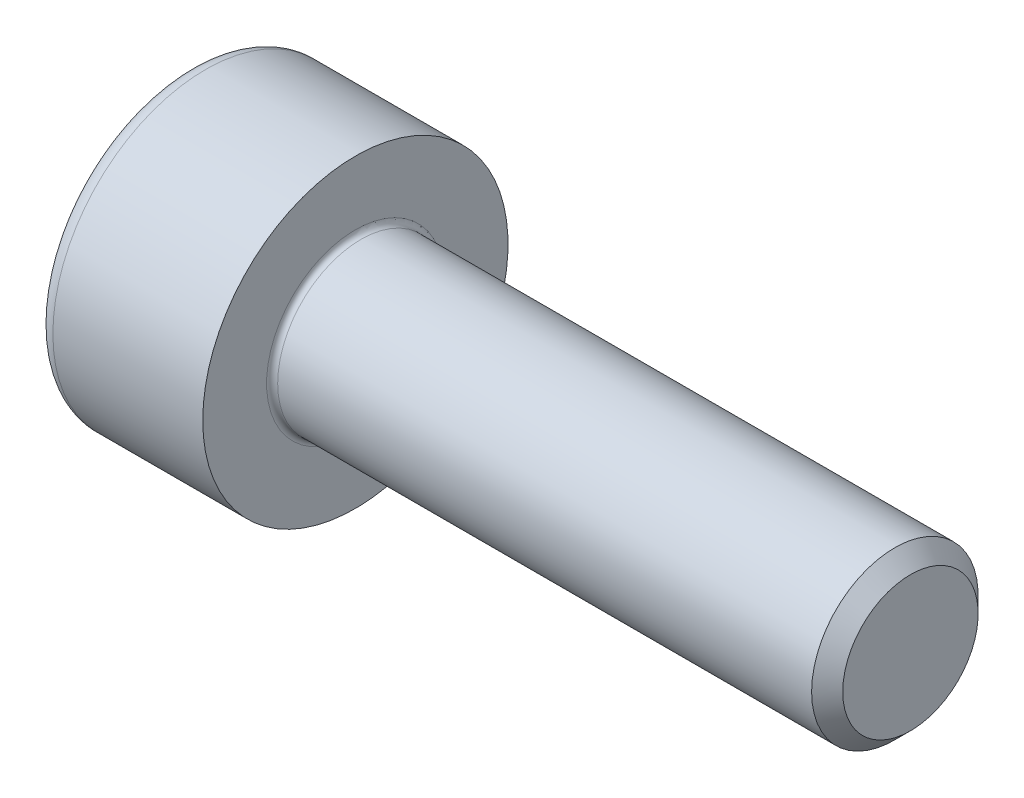
ISO-10303-21;
HEADER;
FILE_DESCRIPTION(('STEP AP214'),'2;1');
FILE_NAME('part.step','',(''),(''),'','','');
FILE_SCHEMA(('AUTOMOTIVE_DESIGN { 1 0 10303 214 1 1 1 1 }'));
ENDSEC;
DATA;
#1=APPLICATION_CONTEXT('core data for automotive mechanical design processes');
#2=APPLICATION_PROTOCOL_DEFINITION('international standard','automotive_design',2000,#1);
#3=PRODUCT_CONTEXT('',#1,'mechanical');
#4=PRODUCT('Part','Part','',(#3));
#5=PRODUCT_RELATED_PRODUCT_CATEGORY('part','',(#4));
#6=PRODUCT_DEFINITION_FORMATION('','',#4);
#7=PRODUCT_DEFINITION_CONTEXT('part definition',#1,'design');
#8=PRODUCT_DEFINITION('design','',#6,#7);
#9=PRODUCT_DEFINITION_SHAPE('','',#8);
#10=(LENGTH_UNIT() NAMED_UNIT(*) SI_UNIT(.MILLI.,.METRE.));
#11=(NAMED_UNIT(*) PLANE_ANGLE_UNIT() SI_UNIT($,.RADIAN.));
#12=(NAMED_UNIT(*) SI_UNIT($,.STERADIAN.) SOLID_ANGLE_UNIT());
#13=UNCERTAINTY_MEASURE_WITH_UNIT(LENGTH_MEASURE(1.E-05),#10,'distance_accuracy_value','');
#14=(GEOMETRIC_REPRESENTATION_CONTEXT(3) GLOBAL_UNCERTAINTY_ASSIGNED_CONTEXT((#13)) GLOBAL_UNIT_ASSIGNED_CONTEXT((#10,
#11,#12)) REPRESENTATION_CONTEXT('',''));
#15=CARTESIAN_POINT('',(0.,0.,0.));
#16=DIRECTION('',(0.,0.,1.));
#17=DIRECTION('',(1.,0.,0.));
#18=AXIS2_PLACEMENT_3D('',#15,#16,#17);
#19=CARTESIAN_POINT('',(0.,0.,0.));
#20=DIRECTION('',(-1.,0.,0.));
#21=DIRECTION('',(0.,0.,1.));
#22=AXIS2_PLACEMENT_3D('',#19,#20,#21);
#23=PLANE('',#22);
#24=DIRECTION('',(0.,-0.499999999999998,0.86602540378444));
#25=VECTOR('',#24,1.);
#26=CARTESIAN_POINT('',(0.,1.45492267835785,0.));
#27=LINE('',#26,#25);
#28=CARTESIAN_POINT('',(0.,1.45492267835785,0.));
#29=VERTEX_POINT('',#28);
#30=CARTESIAN_POINT('',(0.,0.727461339178926,1.26));
#31=VERTEX_POINT('',#30);
#32=EDGE_CURVE('E267',#29,#31,#27,.T.);
#33=ORIENTED_EDGE('',*,*,#32,.T.);
#34=DIRECTION('',(0.,1.,0.));
#35=VECTOR('',#34,1.);
#36=CARTESIAN_POINT('',(0.,-0.72746133917893,1.26));
#37=LINE('',#36,#35);
#38=CARTESIAN_POINT('',(0.,-0.72746133917893,1.26));
#39=VERTEX_POINT('',#38);
#40=EDGE_CURVE('E128',#39,#31,#37,.T.);
#41=ORIENTED_EDGE('',*,*,#40,.F.);
#42=DIRECTION('',(0.,-0.500000000000001,-0.866025403784438));
#43=VECTOR('',#42,1.);
#44=CARTESIAN_POINT('',(0.,-0.72746133917893,1.26));
#45=LINE('',#44,#43);
#46=CARTESIAN_POINT('',(0.,-1.45492267835786,0.));
#47=VERTEX_POINT('',#46);
#48=EDGE_CURVE('E270',#39,#47,#45,.T.);
#49=ORIENTED_EDGE('',*,*,#48,.T.);
#50=DIRECTION('',(0.,0.499999999999998,-0.86602540378444));
#51=VECTOR('',#50,1.);
#52=CARTESIAN_POINT('',(0.,-1.45492267835786,0.));
#53=LINE('',#52,#51);
#54=CARTESIAN_POINT('',(0.,-0.727461339178935,-1.26));
#55=VERTEX_POINT('',#54);
#56=EDGE_CURVE('E273',#47,#55,#53,.T.);
#57=ORIENTED_EDGE('',*,*,#56,.T.);
#58=DIRECTION('',(0.,-1.,0.));
#59=VECTOR('',#58,1.);
#60=CARTESIAN_POINT('',(0.,0.727461339178922,-1.26));
#61=LINE('',#60,#59);
#62=CARTESIAN_POINT('',(0.,0.727461339178922,-1.26));
#63=VERTEX_POINT('',#62);
#64=EDGE_CURVE('E276',#63,#55,#61,.T.);
#65=ORIENTED_EDGE('',*,*,#64,.F.);
#66=DIRECTION('',(0.,-0.500000000000001,-0.866025403784438));
#67=VECTOR('',#66,1.);
#68=CARTESIAN_POINT('',(0.,1.45492267835785,0.));
#69=LINE('',#68,#67);
#70=EDGE_CURVE('E123',#29,#63,#69,.T.);
#71=ORIENTED_EDGE('',*,*,#70,.F.);
#72=EDGE_LOOP('',(#33,#41,#49,#57,#65,#71));
#73=FACE_BOUND('',#72,.T.);
#74=CARTESIAN_POINT('',(0.,0.,0.));
#75=DIRECTION('',(-1.,0.,0.));
#76=DIRECTION('',(0.,0.,1.));
#77=AXIS2_PLACEMENT_3D('',#74,#75,#76);
#78=CIRCLE('',#77,2.45);
#79=CARTESIAN_POINT('',(0.,0.,2.45));
#80=VERTEX_POINT('',#79);
#81=EDGE_CURVE('E44',#80,#80,#78,.T.);
#82=ORIENTED_EDGE('',*,*,#81,.T.);
#83=EDGE_LOOP('',(#82));
#84=FACE_BOUND('',#83,.T.);
#85=ADVANCED_FACE('F36',(#73,#84),#23,.T.);
#86=CARTESIAN_POINT('',(-31.75,0.,0.));
#87=DIRECTION('',(-1.,0.,0.));
#88=DIRECTION('',(0.,0.,1.));
#89=AXIS2_PLACEMENT_3D('',#86,#87,#88);
#90=CYLINDRICAL_SURFACE('',#89,2.75);
#91=CARTESIAN_POINT('',(0.300000000000002,0.,0.));
#92=DIRECTION('',(-1.,0.,0.));
#93=DIRECTION('',(0.,0.,1.));
#94=AXIS2_PLACEMENT_3D('',#91,#92,#93);
#95=CIRCLE('',#94,2.75);
#96=CARTESIAN_POINT('',(0.300000000000002,0.,2.75));
#97=VERTEX_POINT('',#96);
#98=EDGE_CURVE('E11',#97,#97,#95,.F.);
#99=ORIENTED_EDGE('',*,*,#98,.T.);
#100=EDGE_LOOP('',(#99));
#101=FACE_BOUND('',#100,.T.);
#102=CARTESIAN_POINT('',(3.,0.,0.));
#103=DIRECTION('',(-1.,0.,0.));
#104=DIRECTION('',(0.,0.,1.));
#105=AXIS2_PLACEMENT_3D('',#102,#103,#104);
#106=CIRCLE('',#105,2.75);
#107=CARTESIAN_POINT('',(3.,0.,2.75));
#108=VERTEX_POINT('',#107);
#109=EDGE_CURVE('E146',#108,#108,#106,.T.);
#110=ORIENTED_EDGE('',*,*,#109,.T.);
#111=EDGE_LOOP('',(#110));
#112=FACE_BOUND('',#111,.T.);
#113=ADVANCED_FACE('F170',(#101,#112),#90,.T.);
#114=CARTESIAN_POINT('',(3.,2.75,0.));
#115=DIRECTION('',(1.,0.,0.));
#116=DIRECTION('',(0.,0.,-1.));
#117=AXIS2_PLACEMENT_3D('',#114,#115,#116);
#118=PLANE('',#117);
#119=CARTESIAN_POINT('',(3.,0.,0.));
#120=DIRECTION('',(1.,0.,0.));
#121=DIRECTION('',(0.,0.,-1.));
#122=AXIS2_PLACEMENT_3D('',#119,#120,#121);
#123=CIRCLE('',#122,1.59999999999999);
#124=CARTESIAN_POINT('',(3.,0.,-1.59999999999999));
#125=VERTEX_POINT('',#124);
#126=EDGE_CURVE('E149',#125,#125,#123,.F.);
#127=ORIENTED_EDGE('',*,*,#126,.T.);
#128=EDGE_LOOP('',(#127));
#129=FACE_BOUND('',#128,.T.);
#130=ORIENTED_EDGE('',*,*,#109,.F.);
#131=EDGE_LOOP('',(#130));
#132=FACE_BOUND('',#131,.T.);
#133=ADVANCED_FACE('F176',(#129,#132),#118,.T.);
#134=CARTESIAN_POINT('',(-31.75,0.,0.));
#135=DIRECTION('',(-1.,0.,0.));
#136=DIRECTION('',(0.,0.,1.));
#137=AXIS2_PLACEMENT_3D('',#134,#135,#136);
#138=CYLINDRICAL_SURFACE('',#137,1.49999999999999);
#139=CARTESIAN_POINT('',(3.1,0.,0.));
#140=DIRECTION('',(1.,0.,0.));
#141=DIRECTION('',(0.,0.,-1.));
#142=AXIS2_PLACEMENT_3D('',#139,#140,#141);
#143=CIRCLE('',#142,1.49999999999999);
#144=CARTESIAN_POINT('',(3.1,0.,-1.49999999999999));
#145=VERTEX_POINT('',#144);
#146=EDGE_CURVE('E152',#145,#145,#143,.T.);
#147=ORIENTED_EDGE('',*,*,#146,.T.);
#148=EDGE_LOOP('',(#147));
#149=FACE_BOUND('',#148,.T.);
#150=CARTESIAN_POINT('',(12.7195,0.,0.));
#151=DIRECTION('',(-1.,0.,0.));
#152=DIRECTION('',(0.,0.,1.));
#153=AXIS2_PLACEMENT_3D('',#150,#151,#152);
#154=CIRCLE('',#153,1.49999999999997);
#155=CARTESIAN_POINT('',(12.7195,0.,1.49999999999997));
#156=VERTEX_POINT('',#155);
#157=EDGE_CURVE('E143',#156,#156,#154,.T.);
#158=ORIENTED_EDGE('',*,*,#157,.T.);
#159=EDGE_LOOP('',(#158));
#160=FACE_BOUND('',#159,.T.);
#161=ADVANCED_FACE('F182',(#149,#160),#138,.T.);
#162=CARTESIAN_POINT('',(13.,0.,0.));
#163=DIRECTION('',(-1.,0.,0.));
#164=DIRECTION('',(0.,0.,1.));
#165=AXIS2_PLACEMENT_3D('',#162,#163,#164);
#166=CONICAL_SURFACE('',#165,1.2195,0.785398163397355);
#167=ORIENTED_EDGE('',*,*,#157,.F.);
#168=EDGE_LOOP('',(#167));
#169=FACE_BOUND('',#168,.T.);
#170=CARTESIAN_POINT('',(13.,0.,0.));
#171=DIRECTION('',(-1.,0.,0.));
#172=DIRECTION('',(0.,0.,1.));
#173=AXIS2_PLACEMENT_3D('',#170,#171,#172);
#174=CIRCLE('',#173,1.2195);
#175=CARTESIAN_POINT('',(13.,0.,1.2195));
#176=VERTEX_POINT('',#175);
#177=EDGE_CURVE('E139',#176,#176,#174,.T.);
#178=ORIENTED_EDGE('',*,*,#177,.T.);
#179=EDGE_LOOP('',(#178));
#180=FACE_BOUND('',#179,.T.);
#181=ADVANCED_FACE('F186',(#169,#180),#166,.T.);
#182=CARTESIAN_POINT('',(13.,1.2195,0.));
#183=DIRECTION('',(1.,0.,0.));
#184=DIRECTION('',(0.,0.,-1.));
#185=AXIS2_PLACEMENT_3D('',#182,#183,#184);
#186=PLANE('',#185);
#187=ORIENTED_EDGE('',*,*,#177,.F.);
#188=EDGE_LOOP('',(#187));
#189=FACE_BOUND('',#188,.T.);
#190=ADVANCED_FACE('F166',(#189),#186,.T.);
#191=CARTESIAN_POINT('',(3.1,0.,0.));
#192=DIRECTION('',(1.,0.,0.));
#193=DIRECTION('',(0.,0.,-1.));
#194=AXIS2_PLACEMENT_3D('',#191,#192,#193);
#195=TOROIDAL_SURFACE('',#194,1.59999999999999,0.1);
#196=ORIENTED_EDGE('',*,*,#146,.F.);
#197=EDGE_LOOP('',(#196));
#198=FACE_BOUND('',#197,.T.);
#199=ORIENTED_EDGE('',*,*,#126,.F.);
#200=EDGE_LOOP('',(#199));
#201=FACE_BOUND('',#200,.T.);
#202=ADVANCED_FACE('F159',(#198,#201),#195,.F.);
#203=CARTESIAN_POINT('',(0.300000000000002,0.,0.));
#204=DIRECTION('',(-1.,0.,0.));
#205=DIRECTION('',(0.,0.,1.));
#206=AXIS2_PLACEMENT_3D('',#203,#204,#205);
#207=TOROIDAL_SURFACE('',#206,2.45,0.3);
#208=ORIENTED_EDGE('',*,*,#98,.F.);
#209=EDGE_LOOP('',(#208));
#210=FACE_BOUND('',#209,.T.);
#211=ORIENTED_EDGE('',*,*,#81,.F.);
#212=EDGE_LOOP('',(#211));
#213=FACE_BOUND('',#212,.T.);
#214=ADVANCED_FACE('F38',(#210,#213),#207,.T.);
#215=CARTESIAN_POINT('',(1.3,1.45492267835785,0.));
#216=DIRECTION('',(0.,-0.86602540378444,-0.499999999999998));
#217=DIRECTION('',(0.,0.499999999999998,-0.86602540378444));
#218=AXIS2_PLACEMENT_3D('',#215,#216,#217);
#219=PLANE('',#218);
#220=ORIENTED_EDGE('',*,*,#32,.F.);
#221=DIRECTION('',(-1.,0.,0.));
#222=VECTOR('',#221,1.);
#223=CARTESIAN_POINT('',(1.3,1.45492267835785,0.));
#224=LINE('',#223,#222);
#225=CARTESIAN_POINT('',(1.3,1.45492267835785,0.));
#226=VERTEX_POINT('',#225);
#227=EDGE_CURVE('E266',#226,#29,#224,.T.);
#228=ORIENTED_EDGE('',*,*,#227,.F.);
#229=DIRECTION('',(0.,-0.499999999999998,0.86602540378444));
#230=VECTOR('',#229,1.);
#231=CARTESIAN_POINT('',(1.3,1.45492267835785,0.));
#232=LINE('',#231,#230);
#233=CARTESIAN_POINT('',(1.3,1.09119200876839,0.629999999999997));
#234=VERTEX_POINT('',#233);
#235=EDGE_CURVE('E51',#226,#234,#232,.T.);
#236=ORIENTED_EDGE('',*,*,#235,.T.);
#237=CARTESIAN_POINT('',(1.3,0.727461339178926,1.26));
#238=VERTEX_POINT('',#237);
#239=EDGE_CURVE('E109',#234,#238,#232,.T.);
#240=ORIENTED_EDGE('',*,*,#239,.T.);
#241=DIRECTION('',(-1.,0.,0.));
#242=VECTOR('',#241,1.);
#243=CARTESIAN_POINT('',(1.3,0.727461339178926,1.26));
#244=LINE('',#243,#242);
#245=EDGE_CURVE('E121',#238,#31,#244,.T.);
#246=ORIENTED_EDGE('',*,*,#245,.T.);
#247=EDGE_LOOP('',(#220,#228,#236,#240,#246));
#248=FACE_BOUND('',#247,.T.);
#249=ADVANCED_FACE('F120',(#248),#219,.T.);
#250=CARTESIAN_POINT('',(1.3,-0.72746133917893,1.26));
#251=DIRECTION('',(0.,0.,1.));
#252=DIRECTION('',(0.,-1.,0.));
#253=AXIS2_PLACEMENT_3D('',#250,#251,#252);
#254=PLANE('',#253);
#255=ORIENTED_EDGE('',*,*,#40,.T.);
#256=ORIENTED_EDGE('',*,*,#245,.F.);
#257=DIRECTION('',(0.,1.,0.));
#258=VECTOR('',#257,1.);
#259=CARTESIAN_POINT('',(1.3,-0.72746133917893,1.26));
#260=LINE('',#259,#258);
#261=CARTESIAN_POINT('',(1.3,0.,1.26));
#262=VERTEX_POINT('',#261);
#263=EDGE_CURVE('E107',#262,#238,#260,.T.);
#264=ORIENTED_EDGE('',*,*,#263,.F.);
#265=CARTESIAN_POINT('',(1.3,-0.72746133917893,1.26));
#266=VERTEX_POINT('',#265);
#267=EDGE_CURVE('E117',#266,#262,#260,.T.);
#268=ORIENTED_EDGE('',*,*,#267,.F.);
#269=DIRECTION('',(-1.,0.,0.));
#270=VECTOR('',#269,1.);
#271=CARTESIAN_POINT('',(1.3,-0.72746133917893,1.26));
#272=LINE('',#271,#270);
#273=EDGE_CURVE('E130',#266,#39,#272,.T.);
#274=ORIENTED_EDGE('',*,*,#273,.T.);
#275=EDGE_LOOP('',(#255,#256,#264,#268,#274));
#276=FACE_BOUND('',#275,.T.);
#277=ADVANCED_FACE('F125',(#276),#254,.F.);
#278=CARTESIAN_POINT('',(1.3,-0.72746133917893,1.26));
#279=DIRECTION('',(0.,0.866025403784438,-0.500000000000001));
#280=DIRECTION('',(0.,0.500000000000001,0.866025403784438));
#281=AXIS2_PLACEMENT_3D('',#278,#279,#280);
#282=PLANE('',#281);
#283=ORIENTED_EDGE('',*,*,#48,.F.);
#284=ORIENTED_EDGE('',*,*,#273,.F.);
#285=DIRECTION('',(0.,-0.500000000000001,-0.866025403784438));
#286=VECTOR('',#285,1.);
#287=CARTESIAN_POINT('',(1.3,-0.72746133917893,1.26));
#288=LINE('',#287,#286);
#289=CARTESIAN_POINT('',(1.3,-1.09119200876839,0.630000000000002));
#290=VERTEX_POINT('',#289);
#291=EDGE_CURVE('E247',#266,#290,#288,.T.);
#292=ORIENTED_EDGE('',*,*,#291,.T.);
#293=CARTESIAN_POINT('',(1.3,-1.45492267835786,0.));
#294=VERTEX_POINT('',#293);
#295=EDGE_CURVE('E249',#290,#294,#288,.T.);
#296=ORIENTED_EDGE('',*,*,#295,.T.);
#297=DIRECTION('',(-1.,0.,0.));
#298=VECTOR('',#297,1.);
#299=CARTESIAN_POINT('',(1.3,-1.45492267835786,0.));
#300=LINE('',#299,#298);
#301=EDGE_CURVE('E135',#294,#47,#300,.T.);
#302=ORIENTED_EDGE('',*,*,#301,.T.);
#303=EDGE_LOOP('',(#283,#284,#292,#296,#302));
#304=FACE_BOUND('',#303,.T.);
#305=ADVANCED_FACE('F199',(#304),#282,.T.);
#306=CARTESIAN_POINT('',(1.3,-1.45492267835786,0.));
#307=DIRECTION('',(0.,0.86602540378444,0.499999999999998));
#308=DIRECTION('',(0.,-0.499999999999998,0.86602540378444));
#309=AXIS2_PLACEMENT_3D('',#306,#307,#308);
#310=PLANE('',#309);
#311=ORIENTED_EDGE('',*,*,#56,.F.);
#312=ORIENTED_EDGE('',*,*,#301,.F.);
#313=DIRECTION('',(0.,0.499999999999998,-0.86602540378444));
#314=VECTOR('',#313,1.);
#315=CARTESIAN_POINT('',(1.3,-1.45492267835786,0.));
#316=LINE('',#315,#314);
#317=CARTESIAN_POINT('',(1.3,-1.0911920087684,-0.629999999999999));
#318=VERTEX_POINT('',#317);
#319=EDGE_CURVE('E252',#294,#318,#316,.T.);
#320=ORIENTED_EDGE('',*,*,#319,.T.);
#321=CARTESIAN_POINT('',(1.3,-0.727461339178935,-1.26));
#322=VERTEX_POINT('',#321);
#323=EDGE_CURVE('E256',#318,#322,#316,.T.);
#324=ORIENTED_EDGE('',*,*,#323,.T.);
#325=DIRECTION('',(-1.,0.,0.));
#326=VECTOR('',#325,1.);
#327=CARTESIAN_POINT('',(1.3,-0.727461339178935,-1.26));
#328=LINE('',#327,#326);
#329=EDGE_CURVE('E285',#322,#55,#328,.T.);
#330=ORIENTED_EDGE('',*,*,#329,.T.);
#331=EDGE_LOOP('',(#311,#312,#320,#324,#330));
#332=FACE_BOUND('',#331,.T.);
#333=ADVANCED_FACE('F202',(#332),#310,.T.);
#334=CARTESIAN_POINT('',(1.3,0.727461339178922,-1.26));
#335=DIRECTION('',(0.,0.,-1.));
#336=DIRECTION('',(0.,1.,0.));
#337=AXIS2_PLACEMENT_3D('',#334,#335,#336);
#338=PLANE('',#337);
#339=ORIENTED_EDGE('',*,*,#64,.T.);
#340=ORIENTED_EDGE('',*,*,#329,.F.);
#341=DIRECTION('',(0.,-1.,0.));
#342=VECTOR('',#341,1.);
#343=CARTESIAN_POINT('',(1.3,0.727461339178922,-1.26));
#344=LINE('',#343,#342);
#345=CARTESIAN_POINT('',(1.3,0.,-1.26));
#346=VERTEX_POINT('',#345);
#347=EDGE_CURVE('E260',#346,#322,#344,.T.);
#348=ORIENTED_EDGE('',*,*,#347,.F.);
#349=CARTESIAN_POINT('',(1.3,0.727461339178922,-1.26));
#350=VERTEX_POINT('',#349);
#351=EDGE_CURVE('E261',#350,#346,#344,.T.);
#352=ORIENTED_EDGE('',*,*,#351,.F.);
#353=DIRECTION('',(-1.,0.,0.));
#354=VECTOR('',#353,1.);
#355=CARTESIAN_POINT('',(1.3,0.727461339178922,-1.26));
#356=LINE('',#355,#354);
#357=EDGE_CURVE('E282',#350,#63,#356,.T.);
#358=ORIENTED_EDGE('',*,*,#357,.T.);
#359=EDGE_LOOP('',(#339,#340,#348,#352,#358));
#360=FACE_BOUND('',#359,.T.);
#361=ADVANCED_FACE('F206',(#360),#338,.F.);
#362=CARTESIAN_POINT('',(1.3,1.45492267835785,0.));
#363=DIRECTION('',(0.,0.866025403784438,-0.500000000000001));
#364=DIRECTION('',(0.,0.500000000000001,0.866025403784438));
#365=AXIS2_PLACEMENT_3D('',#362,#363,#364);
#366=PLANE('',#365);
#367=ORIENTED_EDGE('',*,*,#70,.T.);
#368=ORIENTED_EDGE('',*,*,#357,.F.);
#369=DIRECTION('',(0.,-0.500000000000001,-0.866025403784438));
#370=VECTOR('',#369,1.);
#371=CARTESIAN_POINT('',(1.3,1.45492267835785,0.));
#372=LINE('',#371,#370);
#373=CARTESIAN_POINT('',(1.3,1.09119200876839,-0.63));
#374=VERTEX_POINT('',#373);
#375=EDGE_CURVE('E264',#374,#350,#372,.T.);
#376=ORIENTED_EDGE('',*,*,#375,.F.);
#377=EDGE_CURVE('E238',#226,#374,#372,.T.);
#378=ORIENTED_EDGE('',*,*,#377,.F.);
#379=ORIENTED_EDGE('',*,*,#227,.T.);
#380=EDGE_LOOP('',(#367,#368,#376,#378,#379));
#381=FACE_BOUND('',#380,.T.);
#382=ADVANCED_FACE('F210',(#381),#366,.F.);
#383=CARTESIAN_POINT('',(1.3,0.727461339178927,1.26));
#384=DIRECTION('',(-1.,0.,0.));
#385=DIRECTION('',(0.,0.,1.));
#386=AXIS2_PLACEMENT_3D('',#383,#384,#385);
#387=PLANE('',#386);
#388=CARTESIAN_POINT('',(1.3,0.,0.));
#389=DIRECTION('',(-1.,0.,0.));
#390=DIRECTION('',(0.,0.,1.));
#391=AXIS2_PLACEMENT_3D('',#388,#389,#390);
#392=CIRCLE('',#391,1.26);
#393=EDGE_CURVE('E129',#290,#262,#392,.T.);
#394=ORIENTED_EDGE('',*,*,#393,.F.);
#395=ORIENTED_EDGE('',*,*,#291,.F.);
#396=ORIENTED_EDGE('',*,*,#267,.T.);
#397=EDGE_LOOP('',(#394,#395,#396));
#398=FACE_BOUND('',#397,.T.);
#399=ADVANCED_FACE('F214',(#398),#387,.T.);
#400=EDGE_CURVE('E133',#318,#290,#392,.T.);
#401=ORIENTED_EDGE('',*,*,#400,.F.);
#402=ORIENTED_EDGE('',*,*,#319,.F.);
#403=ORIENTED_EDGE('',*,*,#295,.F.);
#404=EDGE_LOOP('',(#401,#402,#403));
#405=FACE_BOUND('',#404,.T.);
#406=ADVANCED_FACE('F217',(#405),#387,.T.);
#407=EDGE_CURVE('E291',#346,#318,#392,.T.);
#408=ORIENTED_EDGE('',*,*,#407,.F.);
#409=ORIENTED_EDGE('',*,*,#347,.T.);
#410=ORIENTED_EDGE('',*,*,#323,.F.);
#411=EDGE_LOOP('',(#408,#409,#410));
#412=FACE_BOUND('',#411,.T.);
#413=ADVANCED_FACE('F222',(#412),#387,.T.);
#414=EDGE_CURVE('E241',#374,#346,#392,.T.);
#415=ORIENTED_EDGE('',*,*,#414,.F.);
#416=ORIENTED_EDGE('',*,*,#375,.T.);
#417=ORIENTED_EDGE('',*,*,#351,.T.);
#418=EDGE_LOOP('',(#415,#416,#417));
#419=FACE_BOUND('',#418,.T.);
#420=ADVANCED_FACE('F229',(#419),#387,.T.);
#421=EDGE_CURVE('E140',#234,#374,#392,.T.);
#422=ORIENTED_EDGE('',*,*,#421,.F.);
#423=ORIENTED_EDGE('',*,*,#235,.F.);
#424=ORIENTED_EDGE('',*,*,#377,.T.);
#425=EDGE_LOOP('',(#422,#423,#424));
#426=FACE_BOUND('',#425,.T.);
#427=ADVANCED_FACE('F225',(#426),#387,.T.);
#428=EDGE_CURVE('E112',#262,#234,#392,.T.);
#429=ORIENTED_EDGE('',*,*,#428,.F.);
#430=ORIENTED_EDGE('',*,*,#263,.T.);
#431=ORIENTED_EDGE('',*,*,#239,.F.);
#432=EDGE_LOOP('',(#429,#430,#431));
#433=FACE_BOUND('',#432,.T.);
#434=ADVANCED_FACE('F108',(#433),#387,.T.);
#435=CARTESIAN_POINT('',(1.3,0.,0.));
#436=DIRECTION('',(-1.,0.,0.));
#437=DIRECTION('',(0.,0.,1.));
#438=AXIS2_PLACEMENT_3D('',#435,#436,#437);
#439=CONICAL_SURFACE('',#438,1.26,1.04719755119659);
#440=CARTESIAN_POINT('',(2.02746133917894,0.,0.));
#441=VERTEX_POINT('',#440);
#442=VERTEX_LOOP('',#441);
#443=FACE_BOUND('',#442,.T.);
#444=ORIENTED_EDGE('',*,*,#428,.T.);
#445=ORIENTED_EDGE('',*,*,#421,.T.);
#446=ORIENTED_EDGE('',*,*,#414,.T.);
#447=ORIENTED_EDGE('',*,*,#407,.T.);
#448=ORIENTED_EDGE('',*,*,#400,.T.);
#449=ORIENTED_EDGE('',*,*,#393,.T.);
#450=EDGE_LOOP('',(#444,#445,#446,#447,#448,#449));
#451=FACE_BOUND('',#450,.T.);
#452=ADVANCED_FACE('F194',(#443,#451),#439,.F.);
#453=CLOSED_SHELL('',(#85,#113,#133,#161,#181,#190,#202,#214,#249,#277,#305,#333,#361,#382,#399,
#406,#413,#420,#427,#434,#452));
#454=MANIFOLD_SOLID_BREP('B2',#453);
#455=ADVANCED_BREP_SHAPE_REPRESENTATION('',(#18,#454),#14);
#456=SHAPE_DEFINITION_REPRESENTATION(#9,#455);
ENDSEC;
END-ISO-10303-21;
